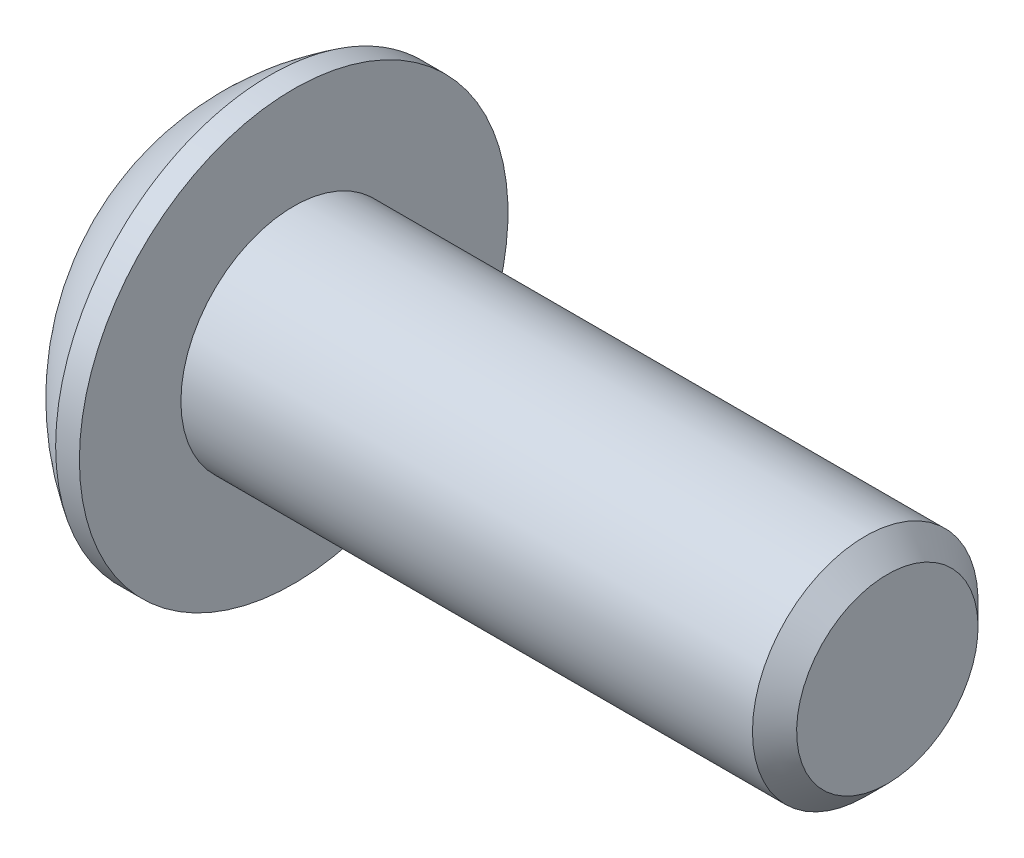
ISO-10303-21;
HEADER;
FILE_DESCRIPTION(('STEP AP214'),'2;1');
FILE_NAME('part.step','',(''),(''),'','','');
FILE_SCHEMA(('AUTOMOTIVE_DESIGN { 1 0 10303 214 1 1 1 1 }'));
ENDSEC;
DATA;
#1=APPLICATION_CONTEXT('core data for automotive mechanical design processes');
#2=APPLICATION_PROTOCOL_DEFINITION('international standard','automotive_design',2000,#1);
#3=PRODUCT_CONTEXT('',#1,'mechanical');
#4=PRODUCT('Part','Part','',(#3));
#5=PRODUCT_RELATED_PRODUCT_CATEGORY('part','',(#4));
#6=PRODUCT_DEFINITION_FORMATION('','',#4);
#7=PRODUCT_DEFINITION_CONTEXT('part definition',#1,'design');
#8=PRODUCT_DEFINITION('design','',#6,#7);
#9=PRODUCT_DEFINITION_SHAPE('','',#8);
#10=(LENGTH_UNIT() NAMED_UNIT(*) SI_UNIT(.MILLI.,.METRE.));
#11=(NAMED_UNIT(*) PLANE_ANGLE_UNIT() SI_UNIT($,.RADIAN.));
#12=(NAMED_UNIT(*) SI_UNIT($,.STERADIAN.) SOLID_ANGLE_UNIT());
#13=UNCERTAINTY_MEASURE_WITH_UNIT(LENGTH_MEASURE(1.E-05),#10,'distance_accuracy_value','');
#14=(GEOMETRIC_REPRESENTATION_CONTEXT(3) GLOBAL_UNCERTAINTY_ASSIGNED_CONTEXT((#13)) GLOBAL_UNIT_ASSIGNED_CONTEXT((#10,
#11,#12)) REPRESENTATION_CONTEXT('',''));
#15=CARTESIAN_POINT('',(0.,0.,0.));
#16=DIRECTION('',(0.,0.,1.));
#17=DIRECTION('',(1.,0.,0.));
#18=AXIS2_PLACEMENT_3D('',#15,#16,#17);
#19=CARTESIAN_POINT('',(1.77800000000017,0.,0.));
#20=DIRECTION('',(-1.,0.,0.));
#21=DIRECTION('',(0.,0.,1.));
#22=AXIS2_PLACEMENT_3D('',#19,#20,#21);
#23=CONICAL_SURFACE('',#22,1.58749999999985,1.04719755119662);
#24=CARTESIAN_POINT('',(2.69454355233856,0.,0.));
#25=VERTEX_POINT('',#24);
#26=VERTEX_LOOP('',#25);
#27=FACE_BOUND('',#26,.T.);
#28=CARTESIAN_POINT('',(1.77800000000017,0.,0.));
#29=DIRECTION('',(-1.,0.,0.));
#30=DIRECTION('',(0.,0.,1.));
#31=AXIS2_PLACEMENT_3D('',#28,#29,#30);
#32=CIRCLE('',#31,1.58749999999985);
#33=CARTESIAN_POINT('',(1.77800000000008,-1.37481532850773,0.793749999999962));
#34=VERTEX_POINT('',#33);
#35=CARTESIAN_POINT('',(1.77800000000008,0.,1.58749999999993));
#36=VERTEX_POINT('',#35);
#37=EDGE_CURVE('E20',#34,#36,#32,.T.);
#38=ORIENTED_EDGE('',*,*,#37,.T.);
#39=CARTESIAN_POINT('',(1.77800000000017,0.,0.));
#40=DIRECTION('',(-1.,0.,0.));
#41=DIRECTION('',(0.,0.,1.));
#42=AXIS2_PLACEMENT_3D('',#39,#40,#41);
#43=CIRCLE('',#42,1.58749999999985);
#44=CARTESIAN_POINT('',(1.77800000000008,1.37481532850773,0.793749999999964));
#45=VERTEX_POINT('',#44);
#46=EDGE_CURVE('E148',#36,#45,#43,.T.);
#47=ORIENTED_EDGE('',*,*,#46,.T.);
#48=CARTESIAN_POINT('',(1.77800000000017,0.,0.));
#49=DIRECTION('',(-1.,0.,0.));
#50=DIRECTION('',(0.,0.,1.));
#51=AXIS2_PLACEMENT_3D('',#48,#49,#50);
#52=CIRCLE('',#51,1.58749999999985);
#53=CARTESIAN_POINT('',(1.77800000000008,1.37481532850773,-0.793749999999964));
#54=VERTEX_POINT('',#53);
#55=EDGE_CURVE('E405',#45,#54,#52,.T.);
#56=ORIENTED_EDGE('',*,*,#55,.T.);
#57=CARTESIAN_POINT('',(1.77800000000017,0.,0.));
#58=DIRECTION('',(-1.,0.,0.));
#59=DIRECTION('',(0.,0.,1.));
#60=AXIS2_PLACEMENT_3D('',#57,#58,#59);
#61=CIRCLE('',#60,1.58749999999985);
#62=CARTESIAN_POINT('',(1.77800000000008,2.13833679173143E-12,-1.58749999999993));
#63=VERTEX_POINT('',#62);
#64=EDGE_CURVE('E406',#54,#63,#61,.T.);
#65=ORIENTED_EDGE('',*,*,#64,.T.);
#66=CARTESIAN_POINT('',(1.77800000000017,0.,0.));
#67=DIRECTION('',(-1.,0.,0.));
#68=DIRECTION('',(0.,0.,1.));
#69=AXIS2_PLACEMENT_3D('',#66,#67,#68);
#70=CIRCLE('',#69,1.58749999999985);
#71=CARTESIAN_POINT('',(1.77800000000008,-1.37481532850773,-0.793749999999963));
#72=VERTEX_POINT('',#71);
#73=EDGE_CURVE('E93',#63,#72,#70,.T.);
#74=ORIENTED_EDGE('',*,*,#73,.T.);
#75=CARTESIAN_POINT('',(1.77800000000017,0.,0.));
#76=DIRECTION('',(-1.,0.,0.));
#77=DIRECTION('',(0.,0.,1.));
#78=AXIS2_PLACEMENT_3D('',#75,#76,#77);
#79=CIRCLE('',#78,1.58749999999985);
#80=EDGE_CURVE('E89',#72,#34,#79,.T.);
#81=ORIENTED_EDGE('',*,*,#80,.T.);
#82=EDGE_LOOP('',(#38,#47,#56,#65,#74,#81));
#83=FACE_BOUND('',#82,.T.);
#84=ADVANCED_FACE('F17',(#27,#83),#23,.F.);
#85=CARTESIAN_POINT('',(1.778,-2.74963065701559,-1.5875));
#86=DIRECTION('',(1.,0.,0.));
#87=DIRECTION('',(0.,0.,-1.));
#88=AXIS2_PLACEMENT_3D('',#85,#86,#87);
#89=PLANE('',#88);
#90=DIRECTION('',(0.,0.5,0.866025403784439));
#91=VECTOR('',#90,1.);
#92=CARTESIAN_POINT('',(1.778,-1.83308710467706,0.));
#93=LINE('',#92,#91);
#94=CARTESIAN_POINT('',(1.778,-0.916543552338531,1.5875));
#95=VERTEX_POINT('',#94);
#96=EDGE_CURVE('E101',#95,#34,#93,.F.);
#97=ORIENTED_EDGE('',*,*,#96,.F.);
#98=DIRECTION('',(0.,1.,0.));
#99=VECTOR('',#98,1.);
#100=CARTESIAN_POINT('',(1.778,-0.916543552338531,1.5875));
#101=LINE('',#100,#99);
#102=EDGE_CURVE('E103',#36,#95,#101,.F.);
#103=ORIENTED_EDGE('',*,*,#102,.F.);
#104=ORIENTED_EDGE('',*,*,#37,.F.);
#105=EDGE_LOOP('',(#97,#103,#104));
#106=FACE_BOUND('',#105,.T.);
#107=ADVANCED_FACE('F99',(#106),#89,.F.);
#108=CARTESIAN_POINT('',(1.778,-2.74963065701559,-1.5875));
#109=DIRECTION('',(1.,0.,0.));
#110=DIRECTION('',(0.,0.,-1.));
#111=AXIS2_PLACEMENT_3D('',#108,#109,#110);
#112=PLANE('',#111);
#113=DIRECTION('',(0.,-0.5,0.866025403784439));
#114=VECTOR('',#113,1.);
#115=CARTESIAN_POINT('',(1.778,-0.916543552338531,-1.5875));
#116=LINE('',#115,#114);
#117=CARTESIAN_POINT('',(1.778,-1.83308710467706,0.));
#118=VERTEX_POINT('',#117);
#119=EDGE_CURVE('E109',#118,#72,#116,.F.);
#120=ORIENTED_EDGE('',*,*,#119,.F.);
#121=DIRECTION('',(0.,0.5,0.866025403784439));
#122=VECTOR('',#121,1.);
#123=CARTESIAN_POINT('',(1.778,-1.83308710467706,0.));
#124=LINE('',#123,#122);
#125=EDGE_CURVE('E106',#34,#118,#124,.F.);
#126=ORIENTED_EDGE('',*,*,#125,.F.);
#127=ORIENTED_EDGE('',*,*,#80,.F.);
#128=EDGE_LOOP('',(#120,#126,#127));
#129=FACE_BOUND('',#128,.T.);
#130=ADVANCED_FACE('F107',(#129),#112,.F.);
#131=CARTESIAN_POINT('',(1.778,-2.74963065701559,-1.5875));
#132=DIRECTION('',(1.,0.,0.));
#133=DIRECTION('',(0.,0.,-1.));
#134=AXIS2_PLACEMENT_3D('',#131,#132,#133);
#135=PLANE('',#134);
#136=DIRECTION('',(0.,1.,0.));
#137=VECTOR('',#136,1.);
#138=CARTESIAN_POINT('',(1.778,0.916543552338531,-1.5875));
#139=LINE('',#138,#137);
#140=CARTESIAN_POINT('',(1.778,-0.916543552338531,-1.5875));
#141=VERTEX_POINT('',#140);
#142=EDGE_CURVE('E376',#141,#63,#139,.T.);
#143=ORIENTED_EDGE('',*,*,#142,.F.);
#144=DIRECTION('',(0.,-0.5,0.866025403784439));
#145=VECTOR('',#144,1.);
#146=CARTESIAN_POINT('',(1.778,-0.916543552338531,-1.5875));
#147=LINE('',#146,#145);
#148=EDGE_CURVE('E388',#72,#141,#147,.F.);
#149=ORIENTED_EDGE('',*,*,#148,.F.);
#150=ORIENTED_EDGE('',*,*,#73,.F.);
#151=EDGE_LOOP('',(#143,#149,#150));
#152=FACE_BOUND('',#151,.T.);
#153=ADVANCED_FACE('F191',(#152),#135,.F.);
#154=CARTESIAN_POINT('',(1.778,-2.74963065701559,-1.5875));
#155=DIRECTION('',(1.,0.,0.));
#156=DIRECTION('',(0.,0.,-1.));
#157=AXIS2_PLACEMENT_3D('',#154,#155,#156);
#158=PLANE('',#157);
#159=DIRECTION('',(0.,-0.500000000000001,-0.866025403784438));
#160=VECTOR('',#159,1.);
#161=CARTESIAN_POINT('',(1.778,1.83308710467706,0.));
#162=LINE('',#161,#160);
#163=CARTESIAN_POINT('',(1.778,0.916543552338531,-1.5875));
#164=VERTEX_POINT('',#163);
#165=EDGE_CURVE('E362',#164,#54,#162,.F.);
#166=ORIENTED_EDGE('',*,*,#165,.F.);
#167=DIRECTION('',(0.,1.,0.));
#168=VECTOR('',#167,1.);
#169=CARTESIAN_POINT('',(1.778,0.916543552338531,-1.5875));
#170=LINE('',#169,#168);
#171=EDGE_CURVE('E373',#63,#164,#170,.T.);
#172=ORIENTED_EDGE('',*,*,#171,.F.);
#173=ORIENTED_EDGE('',*,*,#64,.F.);
#174=EDGE_LOOP('',(#166,#172,#173));
#175=FACE_BOUND('',#174,.T.);
#176=ADVANCED_FACE('F187',(#175),#158,.F.);
#177=CARTESIAN_POINT('',(1.778,-2.74963065701559,-1.5875));
#178=DIRECTION('',(1.,0.,0.));
#179=DIRECTION('',(0.,0.,-1.));
#180=AXIS2_PLACEMENT_3D('',#177,#178,#179);
#181=PLANE('',#180);
#182=DIRECTION('',(0.,0.5,-0.866025403784438));
#183=VECTOR('',#182,1.);
#184=CARTESIAN_POINT('',(1.778,0.916543552338531,1.5875));
#185=LINE('',#184,#183);
#186=CARTESIAN_POINT('',(1.778,1.83308710467706,0.));
#187=VERTEX_POINT('',#186);
#188=EDGE_CURVE('E341',#187,#45,#185,.F.);
#189=ORIENTED_EDGE('',*,*,#188,.F.);
#190=DIRECTION('',(0.,-0.500000000000001,-0.866025403784438));
#191=VECTOR('',#190,1.);
#192=CARTESIAN_POINT('',(1.778,1.83308710467706,0.));
#193=LINE('',#192,#191);
#194=EDGE_CURVE('E360',#54,#187,#193,.F.);
#195=ORIENTED_EDGE('',*,*,#194,.F.);
#196=ORIENTED_EDGE('',*,*,#55,.F.);
#197=EDGE_LOOP('',(#189,#195,#196));
#198=FACE_BOUND('',#197,.T.);
#199=ADVANCED_FACE('F183',(#198),#181,.F.);
#200=CARTESIAN_POINT('',(1.778,-2.74963065701559,-1.5875));
#201=DIRECTION('',(1.,0.,0.));
#202=DIRECTION('',(0.,0.,-1.));
#203=AXIS2_PLACEMENT_3D('',#200,#201,#202);
#204=PLANE('',#203);
#205=DIRECTION('',(0.,1.,0.));
#206=VECTOR('',#205,1.);
#207=CARTESIAN_POINT('',(1.778,-0.916543552338531,1.5875));
#208=LINE('',#207,#206);
#209=CARTESIAN_POINT('',(1.778,0.916543552338531,1.5875));
#210=VERTEX_POINT('',#209);
#211=EDGE_CURVE('E118',#210,#36,#208,.F.);
#212=ORIENTED_EDGE('',*,*,#211,.F.);
#213=DIRECTION('',(0.,0.5,-0.866025403784438));
#214=VECTOR('',#213,1.);
#215=CARTESIAN_POINT('',(1.778,0.916543552338531,1.5875));
#216=LINE('',#215,#214);
#217=EDGE_CURVE('E344',#45,#210,#216,.F.);
#218=ORIENTED_EDGE('',*,*,#217,.F.);
#219=ORIENTED_EDGE('',*,*,#46,.F.);
#220=EDGE_LOOP('',(#212,#218,#219));
#221=FACE_BOUND('',#220,.T.);
#222=ADVANCED_FACE('F179',(#221),#204,.F.);
#223=CARTESIAN_POINT('',(1.778,-0.916543552338531,1.5875));
#224=DIRECTION('',(0.,0.,-1.));
#225=DIRECTION('',(0.,1.,0.));
#226=AXIS2_PLACEMENT_3D('',#223,#224,#225);
#227=PLANE('',#226);
#228=DIRECTION('',(0.,1.,0.));
#229=VECTOR('',#228,1.);
#230=CARTESIAN_POINT('',(0.,0.,1.5875));
#231=LINE('',#230,#229);
#232=CARTESIAN_POINT('',(0.,0.916543552338531,1.5875));
#233=VERTEX_POINT('',#232);
#234=CARTESIAN_POINT('',(0.,-0.916543552338531,1.5875));
#235=VERTEX_POINT('',#234);
#236=EDGE_CURVE('E338',#233,#235,#231,.F.);
#237=ORIENTED_EDGE('',*,*,#236,.F.);
#238=DIRECTION('',(1.,0.,0.));
#239=VECTOR('',#238,1.);
#240=CARTESIAN_POINT('',(1.778,0.916543552338531,1.5875));
#241=LINE('',#240,#239);
#242=EDGE_CURVE('E350',#210,#233,#241,.F.);
#243=ORIENTED_EDGE('',*,*,#242,.F.);
#244=ORIENTED_EDGE('',*,*,#211,.T.);
#245=ORIENTED_EDGE('',*,*,#102,.T.);
#246=DIRECTION('',(1.,0.,0.));
#247=VECTOR('',#246,1.);
#248=CARTESIAN_POINT('',(1.778,-0.916543552338531,1.5875));
#249=LINE('',#248,#247);
#250=EDGE_CURVE('E112',#235,#95,#249,.T.);
#251=ORIENTED_EDGE('',*,*,#250,.F.);
#252=EDGE_LOOP('',(#237,#243,#244,#245,#251));
#253=FACE_BOUND('',#252,.T.);
#254=ADVANCED_FACE('F176',(#253),#227,.T.);
#255=CARTESIAN_POINT('',(1.778,-1.83308710467706,0.));
#256=DIRECTION('',(0.,0.866025403784439,-0.5));
#257=DIRECTION('',(0.,0.5,0.866025403784439));
#258=AXIS2_PLACEMENT_3D('',#255,#256,#257);
#259=PLANE('',#258);
#260=DIRECTION('',(0.,-0.5,-0.866025403784439));
#261=VECTOR('',#260,1.);
#262=CARTESIAN_POINT('',(0.,-0.916543552338531,1.5875));
#263=LINE('',#262,#261);
#264=CARTESIAN_POINT('',(0.,-1.83308710467706,0.));
#265=VERTEX_POINT('',#264);
#266=EDGE_CURVE('E335',#235,#265,#263,.T.);
#267=ORIENTED_EDGE('',*,*,#266,.F.);
#268=ORIENTED_EDGE('',*,*,#250,.T.);
#269=ORIENTED_EDGE('',*,*,#96,.T.);
#270=ORIENTED_EDGE('',*,*,#125,.T.);
#271=DIRECTION('',(1.,0.,0.));
#272=VECTOR('',#271,1.);
#273=CARTESIAN_POINT('',(1.778,-1.83308710467706,0.));
#274=LINE('',#273,#272);
#275=EDGE_CURVE('E385',#265,#118,#274,.T.);
#276=ORIENTED_EDGE('',*,*,#275,.F.);
#277=EDGE_LOOP('',(#267,#268,#269,#270,#276));
#278=FACE_BOUND('',#277,.T.);
#279=ADVANCED_FACE('F116',(#278),#259,.T.);
#280=CARTESIAN_POINT('',(1.778,-0.916543552338531,-1.5875));
#281=DIRECTION('',(0.,0.866025403784439,0.5));
#282=DIRECTION('',(0.,-0.5,0.866025403784439));
#283=AXIS2_PLACEMENT_3D('',#280,#281,#282);
#284=PLANE('',#283);
#285=DIRECTION('',(0.,0.5,-0.866025403784439));
#286=VECTOR('',#285,1.);
#287=CARTESIAN_POINT('',(0.,-1.83308710467706,0.));
#288=LINE('',#287,#286);
#289=CARTESIAN_POINT('',(0.,-0.916543552338531,-1.5875));
#290=VERTEX_POINT('',#289);
#291=EDGE_CURVE('E332',#265,#290,#288,.T.);
#292=ORIENTED_EDGE('',*,*,#291,.F.);
#293=ORIENTED_EDGE('',*,*,#275,.T.);
#294=ORIENTED_EDGE('',*,*,#119,.T.);
#295=ORIENTED_EDGE('',*,*,#148,.T.);
#296=DIRECTION('',(1.,0.,0.));
#297=VECTOR('',#296,1.);
#298=CARTESIAN_POINT('',(1.778,-0.916543552338531,-1.5875));
#299=LINE('',#298,#297);
#300=EDGE_CURVE('E370',#290,#141,#299,.T.);
#301=ORIENTED_EDGE('',*,*,#300,.F.);
#302=EDGE_LOOP('',(#292,#293,#294,#295,#301));
#303=FACE_BOUND('',#302,.T.);
#304=ADVANCED_FACE('F169',(#303),#284,.T.);
#305=CARTESIAN_POINT('',(1.778,0.916543552338531,-1.5875));
#306=DIRECTION('',(0.,0.,1.));
#307=DIRECTION('',(1.,0.,0.));
#308=AXIS2_PLACEMENT_3D('',#305,#306,#307);
#309=PLANE('',#308);
#310=DIRECTION('',(0.,1.,0.));
#311=VECTOR('',#310,1.);
#312=CARTESIAN_POINT('',(0.,0.,-1.5875));
#313=LINE('',#312,#311);
#314=CARTESIAN_POINT('',(0.,0.916543552338531,-1.5875));
#315=VERTEX_POINT('',#314);
#316=EDGE_CURVE('E329',#290,#315,#313,.T.);
#317=ORIENTED_EDGE('',*,*,#316,.F.);
#318=ORIENTED_EDGE('',*,*,#300,.T.);
#319=ORIENTED_EDGE('',*,*,#142,.T.);
#320=ORIENTED_EDGE('',*,*,#171,.T.);
#321=DIRECTION('',(1.,0.,0.));
#322=VECTOR('',#321,1.);
#323=CARTESIAN_POINT('',(1.778,0.916543552338531,-1.5875));
#324=LINE('',#323,#322);
#325=EDGE_CURVE('E345',#315,#164,#324,.T.);
#326=ORIENTED_EDGE('',*,*,#325,.F.);
#327=EDGE_LOOP('',(#317,#318,#319,#320,#326));
#328=FACE_BOUND('',#327,.T.);
#329=ADVANCED_FACE('F166',(#328),#309,.T.);
#330=CARTESIAN_POINT('',(1.778,1.83308710467706,0.));
#331=DIRECTION('',(0.,-0.866025403784438,0.500000000000001));
#332=DIRECTION('',(0.,-0.500000000000001,-0.866025403784438));
#333=AXIS2_PLACEMENT_3D('',#330,#331,#332);
#334=PLANE('',#333);
#335=DIRECTION('',(0.,0.500000000000001,0.866025403784438));
#336=VECTOR('',#335,1.);
#337=CARTESIAN_POINT('',(0.,0.916543552338531,-1.5875));
#338=LINE('',#337,#336);
#339=CARTESIAN_POINT('',(0.,1.83308710467706,0.));
#340=VERTEX_POINT('',#339);
#341=EDGE_CURVE('E326',#315,#340,#338,.T.);
#342=ORIENTED_EDGE('',*,*,#341,.F.);
#343=ORIENTED_EDGE('',*,*,#325,.T.);
#344=ORIENTED_EDGE('',*,*,#165,.T.);
#345=ORIENTED_EDGE('',*,*,#194,.T.);
#346=DIRECTION('',(1.,0.,0.));
#347=VECTOR('',#346,1.);
#348=CARTESIAN_POINT('',(1.778,1.83308710467706,0.));
#349=LINE('',#348,#347);
#350=EDGE_CURVE('E35',#340,#187,#349,.T.);
#351=ORIENTED_EDGE('',*,*,#350,.F.);
#352=EDGE_LOOP('',(#342,#343,#344,#345,#351));
#353=FACE_BOUND('',#352,.T.);
#354=ADVANCED_FACE('F162',(#353),#334,.T.);
#355=CARTESIAN_POINT('',(1.778,0.916543552338531,1.5875));
#356=DIRECTION('',(0.,-0.866025403784438,-0.5));
#357=DIRECTION('',(0.,0.5,-0.866025403784438));
#358=AXIS2_PLACEMENT_3D('',#355,#356,#357);
#359=PLANE('',#358);
#360=DIRECTION('',(0.,-0.5,0.866025403784438));
#361=VECTOR('',#360,1.);
#362=CARTESIAN_POINT('',(0.,1.83308710467706,0.));
#363=LINE('',#362,#361);
#364=EDGE_CURVE('E147',#340,#233,#363,.T.);
#365=ORIENTED_EDGE('',*,*,#364,.F.);
#366=ORIENTED_EDGE('',*,*,#350,.T.);
#367=ORIENTED_EDGE('',*,*,#188,.T.);
#368=ORIENTED_EDGE('',*,*,#217,.T.);
#369=ORIENTED_EDGE('',*,*,#242,.T.);
#370=EDGE_LOOP('',(#365,#366,#367,#368,#369));
#371=FACE_BOUND('',#370,.T.);
#372=ADVANCED_FACE('F158',(#371),#359,.T.);
#373=CARTESIAN_POINT('',(0.,0.,0.));
#374=DIRECTION('',(-1.,0.,0.));
#375=DIRECTION('',(0.,0.,1.));
#376=AXIS2_PLACEMENT_3D('',#373,#374,#375);
#377=PLANE('',#376);
#378=ORIENTED_EDGE('',*,*,#341,.T.);
#379=ORIENTED_EDGE('',*,*,#364,.T.);
#380=ORIENTED_EDGE('',*,*,#236,.T.);
#381=ORIENTED_EDGE('',*,*,#266,.T.);
#382=ORIENTED_EDGE('',*,*,#291,.T.);
#383=ORIENTED_EDGE('',*,*,#316,.T.);
#384=EDGE_LOOP('',(#378,#379,#380,#381,#382,#383));
#385=FACE_BOUND('',#384,.T.);
#386=CARTESIAN_POINT('',(0.,2.29235,0.));
#387=CARTESIAN_POINT('',(0.,2.29234961429956,0.0643619991867153));
#388=CARTESIAN_POINT('',(0.,2.28963695190107,0.128735826629365));
#389=CARTESIAN_POINT('',(0.,2.27880393843647,0.257038618985285));
#390=CARTESIAN_POINT('',(0.,2.27068199085126,0.320967446929161));
#391=CARTESIAN_POINT('',(0.,2.24906694794255,0.448021254607715));
#392=CARTESIAN_POINT('',(-2.10824184437212E-13,2.2355653265346,0.511144793381859));
#393=CARTESIAN_POINT('',(2.11863340668574E-13,2.20328400495643,0.636065176149319));
#394=CARTESIAN_POINT('',(7.898583416728E-13,2.18450002159113,0.697860899533932));
#395=CARTESIAN_POINT('',(1.31296954862567E-12,2.12048422735802,0.880329802927745));
#396=CARTESIAN_POINT('',(0.,2.06753599079458,0.998391795928112));
#397=CARTESIAN_POINT('',(0.,1.94254204858672,1.22393765942147));
#398=CARTESIAN_POINT('',(1.09188685833251E-12,1.87049561696642,1.33142112758208));
#399=CARTESIAN_POINT('',(6.7685541846695E-13,1.7497425419488,1.48237719670934));
#400=CARTESIAN_POINT('',(1.81629011781581E-13,1.707345731323,1.53101280076737));
#401=CARTESIAN_POINT('',(-1.80586950453791E-13,1.61863910291528,1.62450601319185));
#402=CARTESIAN_POINT('',(0.,1.57233309727312,1.66936721890417));
#403=CARTESIAN_POINT('',(0.,1.47608431707233,1.7550488420402));
#404=CARTESIAN_POINT('',(0.,1.42613990458994,1.79586741981511));
#405=CARTESIAN_POINT('',(0.,1.3229945254125,1.87315615311522));
#406=CARTESIAN_POINT('',(0.,1.26979280714187,1.90962529930696));
#407=CARTESIAN_POINT('',(0.,1.10588180153952,2.01207722151089));
#408=CARTESIAN_POINT('',(0.,0.990764947001308,2.07119486286666));
#409=CARTESIAN_POINT('',(0.,0.752302198839715,2.16922858468856));
#410=CARTESIAN_POINT('',(0.,0.628956393121258,2.20814488091449));
#411=CARTESIAN_POINT('',(0.,0.377466101733267,2.26472755765919));
#412=CARTESIAN_POINT('',(0.,0.249321590440378,2.28239382469378));
#413=CARTESIAN_POINT('',(0.,-0.00811435371610919,2.29595665980955));
#414=CARTESIAN_POINT('',(0.,-0.137405786579707,2.29185322789072));
#415=CARTESIAN_POINT('',(0.,-0.393449386933728,2.2620096240906));
#416=CARTESIAN_POINT('',(0.,-0.520201567981086,2.23626956775766));
#417=CARTESIAN_POINT('',(0.,-0.767645294384453,2.16383549332687));
#418=CARTESIAN_POINT('',(0.,-0.888336774993558,2.11714125142685));
#419=CARTESIAN_POINT('',(0.,-1.06210572146656,2.03247976453653));
#420=CARTESIAN_POINT('',(0.,-1.11884498714067,2.00180278323695));
#421=CARTESIAN_POINT('',(0.,-1.22954062855573,1.93578011658035));
#422=CARTESIAN_POINT('',(0.,-1.28349764565393,1.9004355139425));
#423=CARTESIAN_POINT('',(0.,-1.38821676641538,1.82534174602348));
#424=CARTESIAN_POINT('',(0.,-1.43898030563029,1.78559458231503));
#425=CARTESIAN_POINT('',(0.,-1.53701984534431,1.70193996292361));
#426=CARTESIAN_POINT('',(0.,-1.58429243280551,1.65802852924126));
#427=CARTESIAN_POINT('',(0.,-1.72023903553758,1.52059650554138));
#428=CARTESIAN_POINT('',(0.,-1.80318066138239,1.42127847626519));
#429=CARTESIAN_POINT('',(0.,-1.95118232345099,1.21011519784664));
#430=CARTESIAN_POINT('',(0.,-2.01624303935585,1.09827042509272));
#431=CARTESIAN_POINT('',(0.,-2.09907772661315,0.92353823800584));
#432=CARTESIAN_POINT('',(0.,-2.12425103063559,0.864058373981967));
#433=CARTESIAN_POINT('',(0.,-2.16947990046566,0.743221562175602));
#434=CARTESIAN_POINT('',(0.,-2.18953960800684,0.681866178863367));
#435=CARTESIAN_POINT('',(0.,-2.22438542051156,0.55778697240036));
#436=CARTESIAN_POINT('',(0.,-2.23917985294819,0.495065478128176));
#437=CARTESIAN_POINT('',(0.,-2.26343456384454,0.368611258323519));
#438=CARTESIAN_POINT('',(0.,-2.27289641559286,0.304878836759572));
#439=CARTESIAN_POINT('',(0.,-2.28388649696737,0.200873029360627));
#440=CARTESIAN_POINT('',(0.,-2.28705930623294,0.1607661641801));
#441=CARTESIAN_POINT('',(0.,-2.29129117827045,0.0804410725432722));
#442=CARTESIAN_POINT('',(0.,-2.29235024104239,0.0402228460869721));
#443=CARTESIAN_POINT('',(0.,-2.29234961429957,-0.0643619991867166));
#444=CARTESIAN_POINT('',(0.,-2.28963695190108,-0.128735826629366));
#445=CARTESIAN_POINT('',(0.,-2.27880393843648,-0.257038618985286));
#446=CARTESIAN_POINT('',(0.,-2.27068199085127,-0.320967446929162));
#447=CARTESIAN_POINT('',(0.,-2.24906694794256,-0.448021254607716));
#448=CARTESIAN_POINT('',(-2.10791682211012E-13,-2.23556532653461,-0.51114479338186));
#449=CARTESIAN_POINT('',(2.11830812011626E-13,-2.20328400495644,-0.63606517614932));
#450=CARTESIAN_POINT('',(7.89900352979323E-13,-2.18450002159114,-0.697860899533933));
#451=CARTESIAN_POINT('',(1.31288572627556E-12,-2.12048422735803,-0.880329802927746));
#452=CARTESIAN_POINT('',(0.,-2.06753599079459,-0.998391795928114));
#453=CARTESIAN_POINT('',(0.,-1.94254204858673,-1.22393765942147));
#454=CARTESIAN_POINT('',(1.09432969402769E-12,-1.87049561696643,-1.33142112758208));
#455=CARTESIAN_POINT('',(6.78235621887555E-13,-1.74974254194881,-1.48237719670935));
#456=CARTESIAN_POINT('',(1.82023220003121E-13,-1.70734573132301,-1.53101280076737));
#457=CARTESIAN_POINT('',(-1.80980778599231E-13,-1.61863910291529,-1.62450601319185));
#458=CARTESIAN_POINT('',(0.,-1.57233309727313,-1.66936721890417));
#459=CARTESIAN_POINT('',(0.,-1.47608431707234,-1.7550488420402));
#460=CARTESIAN_POINT('',(0.,-1.42613990458995,-1.79586741981511));
#461=CARTESIAN_POINT('',(0.,-1.32299452541251,-1.87315615311522));
#462=CARTESIAN_POINT('',(0.,-1.26979280714188,-1.90962529930696));
#463=CARTESIAN_POINT('',(0.,-1.10588180153953,-2.01207722151089));
#464=CARTESIAN_POINT('',(0.,-0.990764947001315,-2.07119486286666));
#465=CARTESIAN_POINT('',(0.,-0.752302198839722,-2.16922858468855));
#466=CARTESIAN_POINT('',(0.,-0.628956393121265,-2.20814488091449));
#467=CARTESIAN_POINT('',(0.,-0.377466101733275,-2.26472755765919));
#468=CARTESIAN_POINT('',(0.,-0.249321590440386,-2.28239382469378));
#469=CARTESIAN_POINT('',(0.,0.00811435371609967,-2.29595665980955));
#470=CARTESIAN_POINT('',(0.,0.137405786579697,-2.29185322789072));
#471=CARTESIAN_POINT('',(0.,0.393449386933717,-2.2620096240906));
#472=CARTESIAN_POINT('',(0.,0.520201567981075,-2.23626956775766));
#473=CARTESIAN_POINT('',(0.,0.767645294384443,-2.16383549332687));
#474=CARTESIAN_POINT('',(0.,0.888336774993549,-2.11714125142686));
#475=CARTESIAN_POINT('',(0.,1.06210572146655,-2.03247976453654));
#476=CARTESIAN_POINT('',(0.,1.11884498714066,-2.00180278323695));
#477=CARTESIAN_POINT('',(0.,1.22954062855572,-1.93578011658035));
#478=CARTESIAN_POINT('',(0.,1.28349764565392,-1.9004355139425));
#479=CARTESIAN_POINT('',(0.,1.38821676641537,-1.82534174602348));
#480=CARTESIAN_POINT('',(0.,1.43898030563028,-1.78559458231503));
#481=CARTESIAN_POINT('',(0.,1.53701984534431,-1.70193996292362));
#482=CARTESIAN_POINT('',(0.,1.5842924328055,-1.65802852924127));
#483=CARTESIAN_POINT('',(0.,1.72023903553758,-1.52059650554139));
#484=CARTESIAN_POINT('',(0.,1.80318066138238,-1.42127847626519));
#485=CARTESIAN_POINT('',(0.,1.95118232345098,-1.21011519784664));
#486=CARTESIAN_POINT('',(0.,2.01624303935584,-1.09827042509272));
#487=CARTESIAN_POINT('',(0.,2.09907772661314,-0.923538238005841));
#488=CARTESIAN_POINT('',(0.,2.12425103063558,-0.864058373981969));
#489=CARTESIAN_POINT('',(0.,2.16947990046565,-0.743221562175604));
#490=CARTESIAN_POINT('',(0.,2.18953960800683,-0.681866178863368));
#491=CARTESIAN_POINT('',(0.,2.22438542051155,-0.55778697240036));
#492=CARTESIAN_POINT('',(0.,2.23917985294818,-0.495065478128176));
#493=CARTESIAN_POINT('',(0.,2.26343456384453,-0.368611258323519));
#494=CARTESIAN_POINT('',(0.,2.27289641559285,-0.304878836759573));
#495=CARTESIAN_POINT('',(0.,2.28388649696736,-0.200873029360628));
#496=CARTESIAN_POINT('',(0.,2.28705930623293,-0.160766164180101));
#497=CARTESIAN_POINT('',(0.,2.29129117827044,-0.0804410725432734));
#498=CARTESIAN_POINT('',(0.,2.29235024104238,-0.0402228460869733));
#499=CARTESIAN_POINT('',(0.,2.29235,0.));
#500=B_SPLINE_CURVE_WITH_KNOTS('',3,(#386,#387,#388,#389,#390,#391,#392,#393,#394,#395,#396,
#397,#398,#399,#400,#401,#402,#403,#404,#405,#406,#407,#408,#409,#410,#411,#412,#413,#414,#415,
#416,#417,#418,#419,#420,#421,#422,#423,#424,#425,#426,#427,#428,#429,#430,#431,#432,#433,#434,
#435,#436,#437,#438,#439,#440,#441,#442,#443,#444,#445,#446,#447,#448,#449,#450,#451,#452,#453,
#454,#455,#456,#457,#458,#459,#460,#461,#462,#463,#464,#465,#466,#467,#468,#469,#470,#471,#472,
#473,#474,#475,#476,#477,#478,#479,#480,#481,#482,#483,#484,#485,#486,#487,#488,#489,#490,#491,
#492,#493,#494,#495,#496,#497,#498,#499),.UNSPECIFIED.,.T.,.F.,(4,2,2,2,2,2,2,2,2,2,2,2,2,2,2,2,
2,2,2,2,2,2,2,2,2,2,2,2,2,2,2,2,2,2,2,2,2,2,2,2,2,2,2,2,2,2,2,2,2,2,2,2,2,2,2,2,4),(0.,
0.193048968618032,0.386154939782393,0.579568183995957,0.773138711491036,1.15935703864577,
1.54559004914644,1.73895960916368,1.93214273180063,2.12541336477221,2.31872876140888,
2.70495649282618,3.09118009906582,3.47740576789431,3.86363143672284,4.24985504296253,
4.63608277437979,4.82939817101619,5.02266880398747,5.21585192662419,5.40922148664121,
5.79545449714216,6.18167282429724,6.3752433517926,6.5686565960064,6.76176256717088,
6.95481153578907,7.07545693291921,7.19610233004936,7.38915129866739,7.58225726983176,
7.77567051404532,7.9692410415404,8.35545936869513,8.74169237919581,8.93506193921304,
9.12824506184999,9.32151569482157,9.51483109145824,9.90105882287554,10.2872824291152,
10.6735080979437,11.0597337667722,11.4459573730119,11.8321851044291,12.0255005010656,
12.2187711340368,12.4119542566736,12.6053238166906,12.9915568271915,13.3777751543466,
13.571345681842,13.7647589260558,13.9578648972202,14.1509138658384,14.2715592629686,
14.3922046600987),.UNSPECIFIED.);
#501=CARTESIAN_POINT('',(0.,2.29235,0.));
#502=VERTEX_POINT('',#501);
#503=EDGE_CURVE('E140',#502,#502,#500,.T.);
#504=ORIENTED_EDGE('',*,*,#503,.F.);
#505=EDGE_LOOP('',(#504));
#506=FACE_BOUND('',#505,.T.);
#507=ADVANCED_FACE('F154',(#385,#506),#377,.T.);
#508=CARTESIAN_POINT('',(4.85989606481482,0.,0.));
#509=DIRECTION('',(0.,1.,0.));
#510=DIRECTION('',(1.,0.,0.));
#511=AXIS2_PLACEMENT_3D('',#508,#509,#510);
#512=SPHERICAL_SURFACE('',#511,5.37340285883188);
#513=CARTESIAN_POINT('',(2.0574,0.,0.));
#514=DIRECTION('',(-1.,0.,0.));
#515=DIRECTION('',(0.,0.,1.));
#516=AXIS2_PLACEMENT_3D('',#513,#514,#515);
#517=CIRCLE('',#516,4.5847);
#518=CARTESIAN_POINT('',(2.0574,0.,4.5847));
#519=VERTEX_POINT('',#518);
#520=EDGE_CURVE('E137',#519,#519,#517,.F.);
#521=ORIENTED_EDGE('',*,*,#520,.F.);
#522=EDGE_LOOP('',(#521));
#523=FACE_BOUND('',#522,.T.);
#524=ORIENTED_EDGE('',*,*,#503,.T.);
#525=EDGE_LOOP('',(#524));
#526=FACE_BOUND('',#525,.T.);
#527=ADVANCED_FACE('F150',(#523,#526),#512,.T.);
#528=CARTESIAN_POINT('',(15.2654,0.,0.));
#529=DIRECTION('',(-1.,0.,0.));
#530=DIRECTION('',(0.,0.,1.));
#531=AXIS2_PLACEMENT_3D('',#528,#529,#530);
#532=PLANE('',#531);
#533=CARTESIAN_POINT('',(15.2654000000325,0.,0.));
#534=DIRECTION('',(-1.,0.,0.));
#535=DIRECTION('',(0.,-1.,0.));
#536=AXIS2_PLACEMENT_3D('',#533,#534,#535);
#537=CIRCLE('',#536,1.94055999992315);
#538=CARTESIAN_POINT('',(15.2654000000325,-1.94055999992315,0.));
#539=VERTEX_POINT('',#538);
#540=EDGE_CURVE('E134',#539,#539,#537,.T.);
#541=ORIENTED_EDGE('',*,*,#540,.F.);
#542=EDGE_LOOP('',(#541));
#543=FACE_BOUND('',#542,.T.);
#544=ADVANCED_FACE('F221',(#543),#532,.F.);
#545=CARTESIAN_POINT('',(0.,0.,0.));
#546=DIRECTION('',(-1.,0.,0.));
#547=DIRECTION('',(0.,0.,1.));
#548=AXIS2_PLACEMENT_3D('',#545,#546,#547);
#549=CYLINDRICAL_SURFACE('',#548,4.5847);
#550=ORIENTED_EDGE('',*,*,#520,.T.);
#551=EDGE_LOOP('',(#550));
#552=FACE_BOUND('',#551,.T.);
#553=CARTESIAN_POINT('',(2.5654,0.,0.));
#554=DIRECTION('',(-1.,0.,0.));
#555=DIRECTION('',(0.,0.,1.));
#556=AXIS2_PLACEMENT_3D('',#553,#554,#555);
#557=CIRCLE('',#556,4.5847);
#558=CARTESIAN_POINT('',(2.5654,0.,4.5847));
#559=VERTEX_POINT('',#558);
#560=EDGE_CURVE('E131',#559,#559,#557,.T.);
#561=ORIENTED_EDGE('',*,*,#560,.T.);
#562=EDGE_LOOP('',(#561));
#563=FACE_BOUND('',#562,.T.);
#564=ADVANCED_FACE('F218',(#552,#563),#549,.T.);
#565=CARTESIAN_POINT('',(14.7929600000225,0.,0.));
#566=DIRECTION('',(-1.,0.,0.));
#567=DIRECTION('',(0.,-1.,0.));
#568=AXIS2_PLACEMENT_3D('',#565,#566,#567);
#569=CONICAL_SURFACE('',#568,2.41299999993316,0.785398163397448);
#570=CARTESIAN_POINT('',(14.79296,0.,0.));
#571=DIRECTION('',(-1.,0.,0.));
#572=DIRECTION('',(0.,0.,1.));
#573=AXIS2_PLACEMENT_3D('',#570,#571,#572);
#574=CIRCLE('',#573,2.41299999999999);
#575=CARTESIAN_POINT('',(14.79296,0.,2.41299999999999));
#576=VERTEX_POINT('',#575);
#577=EDGE_CURVE('E26',#576,#576,#574,.T.);
#578=ORIENTED_EDGE('',*,*,#577,.F.);
#579=EDGE_LOOP('',(#578));
#580=FACE_BOUND('',#579,.T.);
#581=ORIENTED_EDGE('',*,*,#540,.T.);
#582=EDGE_LOOP('',(#581));
#583=FACE_BOUND('',#582,.T.);
#584=ADVANCED_FACE('F211',(#580,#583),#569,.T.);
#585=CARTESIAN_POINT('',(2.5654,2.41299999999999,0.));
#586=DIRECTION('',(-1.,0.,0.));
#587=DIRECTION('',(0.,0.,1.));
#588=AXIS2_PLACEMENT_3D('',#585,#586,#587);
#589=PLANE('',#588);
#590=CARTESIAN_POINT('',(2.5654,0.,0.));
#591=DIRECTION('',(-1.,0.,0.));
#592=DIRECTION('',(0.,0.,1.));
#593=AXIS2_PLACEMENT_3D('',#590,#591,#592);
#594=CIRCLE('',#593,2.41299999999999);
#595=CARTESIAN_POINT('',(2.5654,0.,2.41299999999999));
#596=VERTEX_POINT('',#595);
#597=EDGE_CURVE('E10',#596,#596,#594,.F.);
#598=ORIENTED_EDGE('',*,*,#597,.F.);
#599=EDGE_LOOP('',(#598));
#600=FACE_BOUND('',#599,.T.);
#601=ORIENTED_EDGE('',*,*,#560,.F.);
#602=EDGE_LOOP('',(#601));
#603=FACE_BOUND('',#602,.T.);
#604=ADVANCED_FACE('F205',(#600,#603),#589,.F.);
#605=CARTESIAN_POINT('',(0.,0.,0.));
#606=DIRECTION('',(-1.,0.,0.));
#607=DIRECTION('',(0.,0.,1.));
#608=AXIS2_PLACEMENT_3D('',#605,#606,#607);
#609=CYLINDRICAL_SURFACE('',#608,2.41299999999999);
#610=ORIENTED_EDGE('',*,*,#597,.T.);
#611=EDGE_LOOP('',(#610));
#612=FACE_BOUND('',#611,.T.);
#613=ORIENTED_EDGE('',*,*,#577,.T.);
#614=EDGE_LOOP('',(#613));
#615=FACE_BOUND('',#614,.T.);
#616=ADVANCED_FACE('F203',(#612,#615),#609,.T.);
#617=CLOSED_SHELL('',(#84,#107,#130,#153,#176,#199,#222,#254,#279,#304,#329,#354,#372,#507,#527,
#544,#564,#584,#604,#616));
#618=MANIFOLD_SOLID_BREP('B1',#617);
#619=ADVANCED_BREP_SHAPE_REPRESENTATION('',(#18,#618),#14);
#620=SHAPE_DEFINITION_REPRESENTATION(#9,#619);
ENDSEC;
END-ISO-10303-21;
